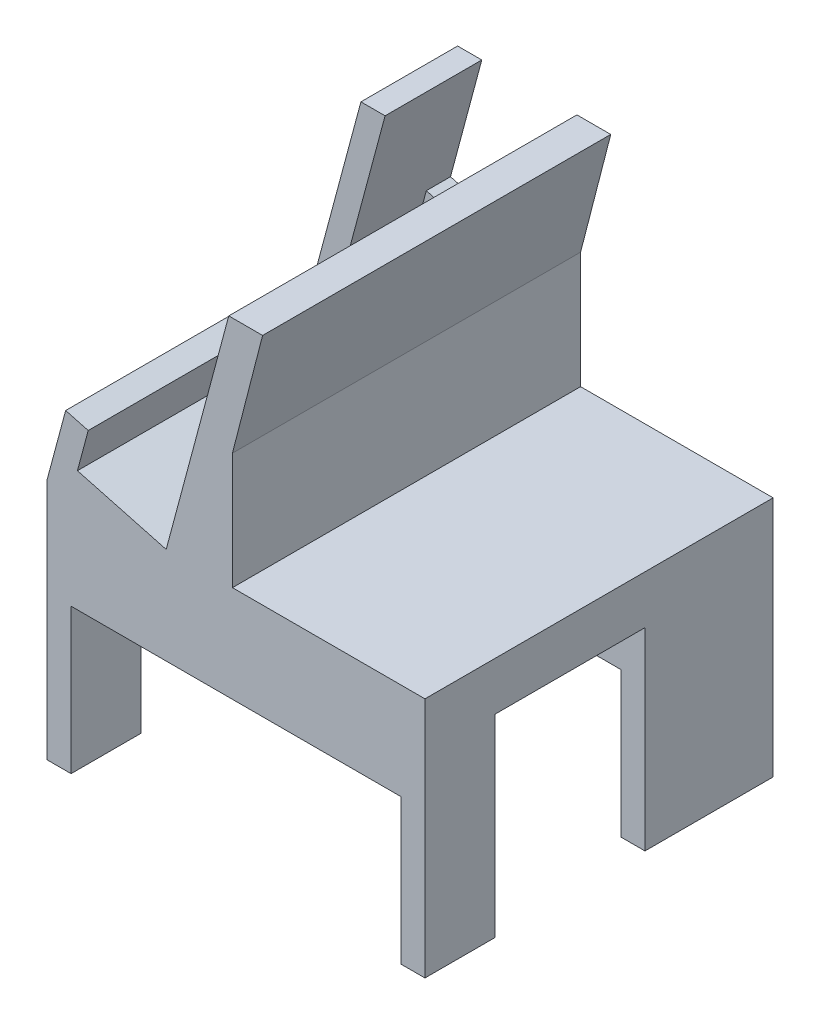
ISO-10303-21;
HEADER;
FILE_DESCRIPTION(('STEP AP214'),'2;1');
FILE_NAME('part.step','',(''),(''),'','','');
FILE_SCHEMA(('AUTOMOTIVE_DESIGN { 1 0 10303 214 1 1 1 1 }'));
ENDSEC;
DATA;
#1=APPLICATION_CONTEXT('core data for automotive mechanical design processes');
#2=APPLICATION_PROTOCOL_DEFINITION('international standard','automotive_design',2000,#1);
#3=PRODUCT_CONTEXT('',#1,'mechanical');
#4=PRODUCT('Part','Part','',(#3));
#5=PRODUCT_RELATED_PRODUCT_CATEGORY('part','',(#4));
#6=PRODUCT_DEFINITION_FORMATION('','',#4);
#7=PRODUCT_DEFINITION_CONTEXT('part definition',#1,'design');
#8=PRODUCT_DEFINITION('design','',#6,#7);
#9=PRODUCT_DEFINITION_SHAPE('','',#8);
#10=(LENGTH_UNIT() NAMED_UNIT(*) SI_UNIT(.MILLI.,.METRE.));
#11=(NAMED_UNIT(*) PLANE_ANGLE_UNIT() SI_UNIT($,.RADIAN.));
#12=(NAMED_UNIT(*) SI_UNIT($,.STERADIAN.) SOLID_ANGLE_UNIT());
#13=UNCERTAINTY_MEASURE_WITH_UNIT(LENGTH_MEASURE(1.E-05),#10,'distance_accuracy_value','');
#14=(GEOMETRIC_REPRESENTATION_CONTEXT(3) GLOBAL_UNCERTAINTY_ASSIGNED_CONTEXT((#13)) GLOBAL_UNIT_ASSIGNED_CONTEXT((#10,
#11,#12)) REPRESENTATION_CONTEXT('',''));
#15=CARTESIAN_POINT('',(0.,0.,0.));
#16=DIRECTION('',(0.,0.,1.));
#17=DIRECTION('',(1.,0.,0.));
#18=AXIS2_PLACEMENT_3D('',#15,#16,#17);
#19=CARTESIAN_POINT('',(0.,13.5714285714286,72.));
#20=DIRECTION('',(0.,1.,0.));
#21=DIRECTION('',(0.,0.,1.));
#22=AXIS2_PLACEMENT_3D('',#19,#20,#21);
#23=PLANE('',#22);
#24=DIRECTION('',(0.,0.,-1.));
#25=VECTOR('',#24,1.);
#26=CARTESIAN_POINT('',(-18.0389702359045,13.5714285714286,5.));
#27=LINE('',#26,#25);
#28=CARTESIAN_POINT('',(-18.0389702359045,13.5714285714286,72.));
#29=VERTEX_POINT('',#28);
#30=CARTESIAN_POINT('',(-18.0389702359045,13.5714285714286,0.));
#31=VERTEX_POINT('',#30);
#32=EDGE_CURVE('E384',#29,#31,#27,.T.);
#33=ORIENTED_EDGE('',*,*,#32,.F.);
#34=DIRECTION('',(1.,0.,0.));
#35=VECTOR('',#34,1.);
#36=CARTESIAN_POINT('',(0.,13.5714285714286,72.));
#37=LINE('',#36,#35);
#38=CARTESIAN_POINT('',(21.7764330264331,13.5714285714286,72.));
#39=VERTEX_POINT('',#38);
#40=EDGE_CURVE('E466',#29,#39,#37,.T.);
#41=ORIENTED_EDGE('',*,*,#40,.T.);
#42=DIRECTION('',(0.,0.,-1.));
#43=VECTOR('',#42,1.);
#44=CARTESIAN_POINT('',(21.7764330264331,13.5714285714286,72.));
#45=LINE('',#44,#43);
#46=CARTESIAN_POINT('',(21.7764330264331,13.5714285714286,0.));
#47=VERTEX_POINT('',#46);
#48=EDGE_CURVE('E497',#39,#47,#45,.T.);
#49=ORIENTED_EDGE('',*,*,#48,.T.);
#50=DIRECTION('',(1.,0.,0.));
#51=VECTOR('',#50,1.);
#52=CARTESIAN_POINT('',(0.,13.5714285714286,0.));
#53=LINE('',#52,#51);
#54=EDGE_CURVE('E489',#31,#47,#53,.T.);
#55=ORIENTED_EDGE('',*,*,#54,.F.);
#56=EDGE_LOOP('',(#33,#41,#49,#55));
#57=FACE_BOUND('',#56,.T.);
#58=ADVANCED_FACE('F101',(#57),#23,.T.);
#59=CARTESIAN_POINT('',(16.7764330264331,0.,72.));
#60=DIRECTION('',(1.,0.,0.));
#61=DIRECTION('',(0.,0.,-1.));
#62=AXIS2_PLACEMENT_3D('',#59,#60,#61);
#63=PLANE('',#62);
#64=DIRECTION('',(0.,0.,-1.));
#65=VECTOR('',#64,1.);
#66=CARTESIAN_POINT('',(16.7764330264331,-6.42857142857144,72.));
#67=LINE('',#66,#65);
#68=CARTESIAN_POINT('',(16.7764330264331,-6.42857142857144,72.));
#69=VERTEX_POINT('',#68);
#70=CARTESIAN_POINT('',(16.7764330264331,-6.42857142857144,57.5));
#71=VERTEX_POINT('',#70);
#72=EDGE_CURVE('E512',#69,#71,#67,.T.);
#73=ORIENTED_EDGE('',*,*,#72,.T.);
#74=DIRECTION('',(0.,-1.,0.));
#75=VECTOR('',#74,1.);
#76=CARTESIAN_POINT('',(16.7764330264331,3.57142857142857,57.5));
#77=LINE('',#76,#75);
#78=CARTESIAN_POINT('',(16.7764330264331,-36.4285714285714,57.5));
#79=VERTEX_POINT('',#78);
#80=EDGE_CURVE('E399',#71,#79,#77,.T.);
#81=ORIENTED_EDGE('',*,*,#80,.T.);
#82=DIRECTION('',(0.,0.,-1.));
#83=VECTOR('',#82,1.);
#84=CARTESIAN_POINT('',(16.7764330264331,-36.4285714285714,72.));
#85=LINE('',#84,#83);
#86=CARTESIAN_POINT('',(16.7764330264331,-36.4285714285714,72.));
#87=VERTEX_POINT('',#86);
#88=EDGE_CURVE('E507',#87,#79,#85,.T.);
#89=ORIENTED_EDGE('',*,*,#88,.F.);
#90=DIRECTION('',(0.,-1.,0.));
#91=VECTOR('',#90,1.);
#92=CARTESIAN_POINT('',(16.7764330264331,0.,72.));
#93=LINE('',#92,#91);
#94=EDGE_CURVE('E454',#69,#87,#93,.T.);
#95=ORIENTED_EDGE('',*,*,#94,.F.);
#96=EDGE_LOOP('',(#73,#81,#89,#95));
#97=FACE_BOUND('',#96,.T.);
#98=ADVANCED_FACE('F658',(#97),#63,.F.);
#99=CARTESIAN_POINT('',(0.,-36.4285714285714,72.));
#100=DIRECTION('',(0.,-1.,0.));
#101=DIRECTION('',(0.,0.,-1.));
#102=AXIS2_PLACEMENT_3D('',#99,#100,#101);
#103=PLANE('',#102);
#104=DIRECTION('',(-1.,0.,0.));
#105=VECTOR('',#104,1.);
#106=CARTESIAN_POINT('',(16.7764330264331,-36.4285714285714,57.5));
#107=LINE('',#106,#105);
#108=CARTESIAN_POINT('',(21.7764330264331,-36.4285714285714,57.5));
#109=VERTEX_POINT('',#108);
#110=EDGE_CURVE('E394',#109,#79,#107,.T.);
#111=ORIENTED_EDGE('',*,*,#110,.F.);
#112=DIRECTION('',(0.,0.,-1.));
#113=VECTOR('',#112,1.);
#114=CARTESIAN_POINT('',(21.7764330264331,-36.4285714285714,72.));
#115=LINE('',#114,#113);
#116=CARTESIAN_POINT('',(21.7764330264331,-36.4285714285714,72.));
#117=VERTEX_POINT('',#116);
#118=EDGE_CURVE('E502',#117,#109,#115,.T.);
#119=ORIENTED_EDGE('',*,*,#118,.F.);
#120=DIRECTION('',(-1.,0.,0.));
#121=VECTOR('',#120,1.);
#122=CARTESIAN_POINT('',(0.,-36.4285714285714,72.));
#123=LINE('',#122,#121);
#124=EDGE_CURVE('E458',#117,#87,#123,.T.);
#125=ORIENTED_EDGE('',*,*,#124,.T.);
#126=ORIENTED_EDGE('',*,*,#88,.T.);
#127=EDGE_LOOP('',(#111,#119,#125,#126));
#128=FACE_BOUND('',#127,.T.);
#129=ADVANCED_FACE('F663',(#128),#103,.T.);
#130=CARTESIAN_POINT('',(-56.4103801603801,-36.4285714285714,72.));
#131=DIRECTION('',(0.,1.,0.));
#132=DIRECTION('',(0.,0.,1.));
#133=AXIS2_PLACEMENT_3D('',#130,#131,#132);
#134=PLANE('',#133);
#135=DIRECTION('',(0.,0.,-1.));
#136=VECTOR('',#135,1.);
#137=CARTESIAN_POINT('',(-51.4103801603801,-36.4285714285714,72.));
#138=LINE('',#137,#136);
#139=CARTESIAN_POINT('',(-51.4103801603801,-36.4285714285714,26.5));
#140=VERTEX_POINT('',#139);
#141=CARTESIAN_POINT('',(-51.4103801603801,-36.4285714285714,0.));
#142=VERTEX_POINT('',#141);
#143=EDGE_CURVE('E529',#140,#142,#138,.T.);
#144=ORIENTED_EDGE('',*,*,#143,.F.);
#145=DIRECTION('',(1.,0.,0.));
#146=VECTOR('',#145,1.);
#147=CARTESIAN_POINT('',(-51.4103801603801,-36.4285714285714,26.5));
#148=LINE('',#147,#146);
#149=CARTESIAN_POINT('',(-56.4103801603801,-36.4285714285714,26.5));
#150=VERTEX_POINT('',#149);
#151=EDGE_CURVE('E418',#150,#140,#148,.T.);
#152=ORIENTED_EDGE('',*,*,#151,.F.);
#153=DIRECTION('',(0.,0.,-1.));
#154=VECTOR('',#153,1.);
#155=CARTESIAN_POINT('',(-56.4103801603801,-36.4285714285714,72.));
#156=LINE('',#155,#154);
#157=CARTESIAN_POINT('',(-56.4103801603801,-36.4285714285714,0.));
#158=VERTEX_POINT('',#157);
#159=EDGE_CURVE('E539',#150,#158,#156,.T.);
#160=ORIENTED_EDGE('',*,*,#159,.T.);
#161=DIRECTION('',(1.,0.,0.));
#162=VECTOR('',#161,1.);
#163=CARTESIAN_POINT('',(-56.4103801603801,-36.4285714285714,0.));
#164=LINE('',#163,#162);
#165=EDGE_CURVE('E526',#158,#142,#164,.T.);
#166=ORIENTED_EDGE('',*,*,#165,.T.);
#167=EDGE_LOOP('',(#144,#152,#160,#166));
#168=FACE_BOUND('',#167,.T.);
#169=ADVANCED_FACE('F643',(#168),#134,.F.);
#170=CARTESIAN_POINT('',(-51.4103801603801,-6.42857142857144,72.));
#171=DIRECTION('',(1.,0.,0.));
#172=DIRECTION('',(0.,1.,0.));
#173=AXIS2_PLACEMENT_3D('',#170,#171,#172);
#174=PLANE('',#173);
#175=DIRECTION('',(0.,-1.,0.));
#176=VECTOR('',#175,1.);
#177=CARTESIAN_POINT('',(-51.4103801603801,3.57142857142857,26.5));
#178=LINE('',#177,#176);
#179=CARTESIAN_POINT('',(-51.4103801603801,-6.42857142857144,26.5));
#180=VERTEX_POINT('',#179);
#181=EDGE_CURVE('E423',#180,#140,#178,.T.);
#182=ORIENTED_EDGE('',*,*,#181,.T.);
#183=ORIENTED_EDGE('',*,*,#143,.T.);
#184=DIRECTION('',(0.,-1.,0.));
#185=VECTOR('',#184,1.);
#186=CARTESIAN_POINT('',(-51.4103801603801,-6.42857142857144,0.));
#187=LINE('',#186,#185);
#188=CARTESIAN_POINT('',(-51.4103801603801,-6.42857142857144,0.));
#189=VERTEX_POINT('',#188);
#190=EDGE_CURVE('E444',#189,#142,#187,.T.);
#191=ORIENTED_EDGE('',*,*,#190,.F.);
#192=DIRECTION('',(0.,0.,-1.));
#193=VECTOR('',#192,1.);
#194=CARTESIAN_POINT('',(-51.4103801603801,-6.42857142857144,72.));
#195=LINE('',#194,#193);
#196=EDGE_CURVE('E516',#180,#189,#195,.T.);
#197=ORIENTED_EDGE('',*,*,#196,.F.);
#198=EDGE_LOOP('',(#182,#183,#191,#197));
#199=FACE_BOUND('',#198,.T.);
#200=ADVANCED_FACE('F638',(#199),#174,.T.);
#201=CARTESIAN_POINT('',(0.,-6.42857142857144,72.));
#202=DIRECTION('',(0.,1.,0.));
#203=DIRECTION('',(-1.,0.,0.));
#204=AXIS2_PLACEMENT_3D('',#201,#202,#203);
#205=PLANE('',#204);
#206=CARTESIAN_POINT('',(-51.4103801603801,-6.42857142857144,72.));
#207=VERTEX_POINT('',#206);
#208=CARTESIAN_POINT('',(-51.4103801603801,-6.42857142857144,57.5));
#209=VERTEX_POINT('',#208);
#210=EDGE_CURVE('E517',#207,#209,#195,.T.);
#211=ORIENTED_EDGE('',*,*,#210,.T.);
#212=DIRECTION('',(-1.,0.,0.));
#213=VECTOR('',#212,1.);
#214=CARTESIAN_POINT('',(-51.4103801603801,-6.42857142857144,57.5));
#215=LINE('',#214,#213);
#216=EDGE_CURVE('E441',#71,#209,#215,.T.);
#217=ORIENTED_EDGE('',*,*,#216,.F.);
#218=ORIENTED_EDGE('',*,*,#72,.F.);
#219=DIRECTION('',(1.,0.,0.));
#220=VECTOR('',#219,1.);
#221=CARTESIAN_POINT('',(0.,-6.42857142857144,72.));
#222=LINE('',#221,#220);
#223=EDGE_CURVE('E451',#207,#69,#222,.T.);
#224=ORIENTED_EDGE('',*,*,#223,.F.);
#225=EDGE_LOOP('',(#211,#217,#218,#224));
#226=FACE_BOUND('',#225,.T.);
#227=ADVANCED_FACE('F676',(#226),#205,.F.);
#228=CARTESIAN_POINT('',(16.7764330264331,-6.42857142857144,26.5));
#229=VERTEX_POINT('',#228);
#230=CARTESIAN_POINT('',(16.7764330264331,-6.42857142857144,0.));
#231=VERTEX_POINT('',#230);
#232=EDGE_CURVE('E511',#229,#231,#67,.T.);
#233=ORIENTED_EDGE('',*,*,#232,.F.);
#234=DIRECTION('',(1.,0.,0.));
#235=VECTOR('',#234,1.);
#236=CARTESIAN_POINT('',(-51.4103801603801,-6.42857142857144,26.5));
#237=LINE('',#236,#235);
#238=EDGE_CURVE('E427',#180,#229,#237,.T.);
#239=ORIENTED_EDGE('',*,*,#238,.F.);
#240=ORIENTED_EDGE('',*,*,#196,.T.);
#241=DIRECTION('',(1.,0.,0.));
#242=VECTOR('',#241,1.);
#243=CARTESIAN_POINT('',(0.,-6.42857142857144,0.));
#244=LINE('',#243,#242);
#245=EDGE_CURVE('E472',#189,#231,#244,.T.);
#246=ORIENTED_EDGE('',*,*,#245,.T.);
#247=EDGE_LOOP('',(#233,#239,#240,#246));
#248=FACE_BOUND('',#247,.T.);
#249=ADVANCED_FACE('F633',(#248),#205,.F.);
#250=CARTESIAN_POINT('',(16.7764330264331,-36.4285714285714,26.5));
#251=VERTEX_POINT('',#250);
#252=CARTESIAN_POINT('',(16.7764330264331,-36.4285714285714,0.));
#253=VERTEX_POINT('',#252);
#254=EDGE_CURVE('E506',#251,#253,#85,.T.);
#255=ORIENTED_EDGE('',*,*,#254,.F.);
#256=DIRECTION('',(0.,-1.,0.));
#257=VECTOR('',#256,1.);
#258=CARTESIAN_POINT('',(16.7764330264331,3.57142857142857,26.5));
#259=LINE('',#258,#257);
#260=EDGE_CURVE('E393',#229,#251,#259,.T.);
#261=ORIENTED_EDGE('',*,*,#260,.F.);
#262=ORIENTED_EDGE('',*,*,#232,.T.);
#263=DIRECTION('',(0.,-1.,0.));
#264=VECTOR('',#263,1.);
#265=CARTESIAN_POINT('',(16.7764330264331,0.,0.));
#266=LINE('',#265,#264);
#267=EDGE_CURVE('E476',#231,#253,#266,.T.);
#268=ORIENTED_EDGE('',*,*,#267,.T.);
#269=EDGE_LOOP('',(#255,#261,#262,#268));
#270=FACE_BOUND('',#269,.T.);
#271=ADVANCED_FACE('F628',(#270),#63,.F.);
#272=DIRECTION('',(1.,0.,0.));
#273=VECTOR('',#272,1.);
#274=CARTESIAN_POINT('',(16.7764330264331,-36.4285714285714,26.5));
#275=LINE('',#274,#273);
#276=CARTESIAN_POINT('',(21.7764330264331,-36.4285714285714,26.5));
#277=VERTEX_POINT('',#276);
#278=EDGE_CURVE('E388',#251,#277,#275,.T.);
#279=ORIENTED_EDGE('',*,*,#278,.F.);
#280=ORIENTED_EDGE('',*,*,#254,.T.);
#281=DIRECTION('',(-1.,0.,0.));
#282=VECTOR('',#281,1.);
#283=CARTESIAN_POINT('',(0.,-36.4285714285714,0.));
#284=LINE('',#283,#282);
#285=CARTESIAN_POINT('',(21.7764330264331,-36.4285714285714,0.));
#286=VERTEX_POINT('',#285);
#287=EDGE_CURVE('E481',#286,#253,#284,.T.);
#288=ORIENTED_EDGE('',*,*,#287,.F.);
#289=EDGE_CURVE('E501',#277,#286,#115,.T.);
#290=ORIENTED_EDGE('',*,*,#289,.F.);
#291=EDGE_LOOP('',(#279,#280,#288,#290));
#292=FACE_BOUND('',#291,.T.);
#293=ADVANCED_FACE('F624',(#292),#103,.T.);
#294=CARTESIAN_POINT('',(21.7764330264331,0.,72.));
#295=DIRECTION('',(-1.,0.,0.));
#296=DIRECTION('',(0.,-1.,0.));
#297=AXIS2_PLACEMENT_3D('',#294,#295,#296);
#298=PLANE('',#297);
#299=ORIENTED_EDGE('',*,*,#118,.T.);
#300=DIRECTION('',(0.,-1.,0.));
#301=VECTOR('',#300,1.);
#302=CARTESIAN_POINT('',(21.7764330264331,3.57142857142857,57.5));
#303=LINE('',#302,#301);
#304=CARTESIAN_POINT('',(21.7764330264331,3.57142857142857,57.5));
#305=VERTEX_POINT('',#304);
#306=EDGE_CURVE('E404',#305,#109,#303,.T.);
#307=ORIENTED_EDGE('',*,*,#306,.F.);
#308=DIRECTION('',(0.,0.,1.));
#309=VECTOR('',#308,1.);
#310=CARTESIAN_POINT('',(21.7764330264331,3.57142857142857,57.5));
#311=LINE('',#310,#309);
#312=CARTESIAN_POINT('',(21.7764330264331,3.57142857142857,26.5));
#313=VERTEX_POINT('',#312);
#314=EDGE_CURVE('E389',#313,#305,#311,.T.);
#315=ORIENTED_EDGE('',*,*,#314,.F.);
#316=DIRECTION('',(0.,-1.,0.));
#317=VECTOR('',#316,1.);
#318=CARTESIAN_POINT('',(21.7764330264331,3.57142857142857,26.5));
#319=LINE('',#318,#317);
#320=EDGE_CURVE('E407',#313,#277,#319,.T.);
#321=ORIENTED_EDGE('',*,*,#320,.T.);
#322=ORIENTED_EDGE('',*,*,#289,.T.);
#323=DIRECTION('',(0.,1.,0.));
#324=VECTOR('',#323,1.);
#325=CARTESIAN_POINT('',(21.7764330264331,0.,0.));
#326=LINE('',#325,#324);
#327=EDGE_CURVE('E485',#286,#47,#326,.T.);
#328=ORIENTED_EDGE('',*,*,#327,.T.);
#329=ORIENTED_EDGE('',*,*,#48,.F.);
#330=DIRECTION('',(0.,1.,0.));
#331=VECTOR('',#330,1.);
#332=CARTESIAN_POINT('',(21.7764330264331,0.,72.));
#333=LINE('',#332,#331);
#334=EDGE_CURVE('E462',#117,#39,#333,.T.);
#335=ORIENTED_EDGE('',*,*,#334,.F.);
#336=EDGE_LOOP('',(#299,#307,#315,#321,#322,#328,#329,#335));
#337=FACE_BOUND('',#336,.T.);
#338=ADVANCED_FACE('F618',(#337),#298,.F.);
#339=CARTESIAN_POINT('',(-56.4103801603801,0.,72.));
#340=DIRECTION('',(-1.,0.,0.));
#341=DIRECTION('',(0.,0.,1.));
#342=AXIS2_PLACEMENT_3D('',#339,#340,#341);
#343=PLANE('',#342);
#344=DIRECTION('',(0.,-1.,0.));
#345=VECTOR('',#344,1.);
#346=CARTESIAN_POINT('',(-56.4103801603801,3.57142857142857,26.5));
#347=LINE('',#346,#345);
#348=CARTESIAN_POINT('',(-56.4103801603801,3.57142857142857,26.5));
#349=VERTEX_POINT('',#348);
#350=EDGE_CURVE('E428',#349,#150,#347,.T.);
#351=ORIENTED_EDGE('',*,*,#350,.F.);
#352=DIRECTION('',(0.,0.,-1.));
#353=VECTOR('',#352,1.);
#354=CARTESIAN_POINT('',(-56.4103801603801,3.57142857142857,26.5));
#355=LINE('',#354,#353);
#356=CARTESIAN_POINT('',(-56.4103801603801,3.57142857142857,57.5));
#357=VERTEX_POINT('',#356);
#358=EDGE_CURVE('E413',#357,#349,#355,.T.);
#359=ORIENTED_EDGE('',*,*,#358,.F.);
#360=DIRECTION('',(0.,-1.,0.));
#361=VECTOR('',#360,1.);
#362=CARTESIAN_POINT('',(-56.4103801603801,3.57142857142857,57.5));
#363=LINE('',#362,#361);
#364=CARTESIAN_POINT('',(-56.4103801603801,-36.4285714285714,57.5));
#365=VERTEX_POINT('',#364);
#366=EDGE_CURVE('E431',#357,#365,#363,.T.);
#367=ORIENTED_EDGE('',*,*,#366,.T.);
#368=CARTESIAN_POINT('',(-56.4103801603801,-36.4285714285714,72.));
#369=VERTEX_POINT('',#368);
#370=EDGE_CURVE('E477',#369,#365,#156,.T.);
#371=ORIENTED_EDGE('',*,*,#370,.F.);
#372=DIRECTION('',(0.,1.,0.));
#373=VECTOR('',#372,1.);
#374=CARTESIAN_POINT('',(-56.4103801603801,0.,72.));
#375=LINE('',#374,#373);
#376=CARTESIAN_POINT('',(-56.4103801603801,13.5714285714286,72.));
#377=VERTEX_POINT('',#376);
#378=EDGE_CURVE('E469',#369,#377,#375,.T.);
#379=ORIENTED_EDGE('',*,*,#378,.T.);
#380=DIRECTION('',(0.,0.,-1.));
#381=VECTOR('',#380,1.);
#382=CARTESIAN_POINT('',(-56.4103801603801,13.5714285714286,72.));
#383=LINE('',#382,#381);
#384=CARTESIAN_POINT('',(-56.4103801603801,13.5714285714286,0.));
#385=VERTEX_POINT('',#384);
#386=EDGE_CURVE('E307',#377,#385,#383,.T.);
#387=ORIENTED_EDGE('',*,*,#386,.T.);
#388=DIRECTION('',(0.,1.,0.));
#389=VECTOR('',#388,1.);
#390=CARTESIAN_POINT('',(-56.4103801603801,0.,0.));
#391=LINE('',#390,#389);
#392=EDGE_CURVE('E455',#158,#385,#391,.T.);
#393=ORIENTED_EDGE('',*,*,#392,.F.);
#394=ORIENTED_EDGE('',*,*,#159,.F.);
#395=EDGE_LOOP('',(#351,#359,#367,#371,#379,#387,#393,#394));
#396=FACE_BOUND('',#395,.T.);
#397=ADVANCED_FACE('F668',(#396),#343,.T.);
#398=CARTESIAN_POINT('',(0.,0.,72.));
#399=DIRECTION('',(0.,0.,1.));
#400=DIRECTION('',(1.,0.,0.));
#401=AXIS2_PLACEMENT_3D('',#398,#399,#400);
#402=PLANE('',#401);
#403=DIRECTION('',(-0.965925826289069,0.258819045102518,0.));
#404=VECTOR('',#403,1.);
#405=CARTESIAN_POINT('',(-47.698465352397,26.766220740252,72.));
#406=LINE('',#405,#404);
#407=CARTESIAN_POINT('',(-47.8630309743813,26.8103159657646,72.));
#408=VERTEX_POINT('',#407);
#409=CARTESIAN_POINT('',(-52.5280944838424,28.0603159657646,72.));
#410=VERTEX_POINT('',#409);
#411=EDGE_CURVE('E288',#408,#410,#406,.T.);
#412=ORIENTED_EDGE('',*,*,#411,.T.);
#413=DIRECTION('',(-0.258819045102518,-0.965925826289069,0.));
#414=VECTOR('',#413,1.);
#415=CARTESIAN_POINT('',(-56.0244583510607,15.0117083715576,72.));
#416=LINE('',#415,#414);
#417=EDGE_CURVE('E297',#410,#377,#416,.T.);
#418=ORIENTED_EDGE('',*,*,#417,.T.);
#419=ORIENTED_EDGE('',*,*,#378,.F.);
#420=DIRECTION('',(1.,0.,0.));
#421=VECTOR('',#420,1.);
#422=CARTESIAN_POINT('',(-56.4103801603801,-36.4285714285714,72.));
#423=LINE('',#422,#421);
#424=CARTESIAN_POINT('',(-51.4103801603801,-36.4285714285714,72.));
#425=VERTEX_POINT('',#424);
#426=EDGE_CURVE('E525',#369,#425,#423,.T.);
#427=ORIENTED_EDGE('',*,*,#426,.T.);
#428=DIRECTION('',(0.,-1.,0.));
#429=VECTOR('',#428,1.);
#430=CARTESIAN_POINT('',(-51.4103801603801,-6.42857142857144,72.));
#431=LINE('',#430,#429);
#432=EDGE_CURVE('E521',#207,#425,#431,.T.);
#433=ORIENTED_EDGE('',*,*,#432,.F.);
#434=ORIENTED_EDGE('',*,*,#223,.T.);
#435=ORIENTED_EDGE('',*,*,#94,.T.);
#436=ORIENTED_EDGE('',*,*,#124,.F.);
#437=ORIENTED_EDGE('',*,*,#334,.T.);
#438=ORIENTED_EDGE('',*,*,#40,.F.);
#439=DIRECTION('',(0.,1.,0.));
#440=VECTOR('',#439,1.);
#441=CARTESIAN_POINT('',(-18.0389702359045,0.,72.));
#442=LINE('',#441,#440);
#443=CARTESIAN_POINT('',(-18.0389702359045,37.6589399957173,72.));
#444=VERTEX_POINT('',#443);
#445=EDGE_CURVE('E559',#29,#444,#442,.T.);
#446=ORIENTED_EDGE('',*,*,#445,.T.);
#447=DIRECTION('',(0.249591590337671,0.96835119560659,0.));
#448=VECTOR('',#447,1.);
#449=CARTESIAN_POINT('',(-26.0170916170386,6.70588036873319,72.));
#450=LINE('',#449,#448);
#451=CARTESIAN_POINT('',(-11.7991804774627,61.867719885882,72.));
#452=VERTEX_POINT('',#451);
#453=EDGE_CURVE('E591',#444,#452,#450,.T.);
#454=ORIENTED_EDGE('',*,*,#453,.T.);
#455=DIRECTION('',(-1.,0.,0.));
#456=VECTOR('',#455,1.);
#457=CARTESIAN_POINT('',(0.,61.867719885882,72.));
#458=LINE('',#457,#456);
#459=CARTESIAN_POINT('',(-18.7991804774627,61.867719885882,72.));
#460=VERTEX_POINT('',#459);
#461=EDGE_CURVE('E327',#452,#460,#458,.T.);
#462=ORIENTED_EDGE('',*,*,#461,.T.);
#463=DIRECTION('',(0.258819045102518,0.965925826289069,0.));
#464=VECTOR('',#463,1.);
#465=CARTESIAN_POINT('',(-33.0068041421073,8.84414651460977,72.));
#466=LINE('',#465,#464);
#467=CARTESIAN_POINT('',(-31.7401327325886,13.5714285714286,72.));
#468=VERTEX_POINT('',#467);
#469=EDGE_CURVE('E560',#468,#460,#466,.T.);
#470=ORIENTED_EDGE('',*,*,#469,.F.);
#471=DIRECTION('',(0.965925826289069,-0.258819045102518,0.));
#472=VECTOR('',#471,1.);
#473=CARTESIAN_POINT('',(1.26667140951872,4.72728205681878,72.));
#474=LINE('',#473,#472);
#475=CARTESIAN_POINT('',(-50.0927234320809,18.4889904283764,72.));
#476=VERTEX_POINT('',#475);
#477=EDGE_CURVE('E323',#476,#468,#474,.T.);
#478=ORIENTED_EDGE('',*,*,#477,.F.);
#479=DIRECTION('',(-0.258819045102518,-0.965925826289069,0.));
#480=VECTOR('',#479,1.);
#481=CARTESIAN_POINT('',(-51.3593948415996,13.7617083715576,72.));
#482=LINE('',#481,#480);
#483=EDGE_CURVE('E300',#408,#476,#482,.T.);
#484=ORIENTED_EDGE('',*,*,#483,.F.);
#485=EDGE_LOOP('',(#412,#418,#419,#427,#433,#434,#435,#436,#437,#438,#446,#454,#462,#470,#478,#484));
#486=FACE_BOUND('',#485,.T.);
#487=ADVANCED_FACE('F296',(#486),#402,.T.);
#488=CARTESIAN_POINT('',(0.,0.,0.));
#489=DIRECTION('',(0.,0.,1.));
#490=DIRECTION('',(1.,0.,0.));
#491=AXIS2_PLACEMENT_3D('',#488,#489,#490);
#492=PLANE('',#491);
#493=ORIENTED_EDGE('',*,*,#245,.F.);
#494=ORIENTED_EDGE('',*,*,#190,.T.);
#495=ORIENTED_EDGE('',*,*,#165,.F.);
#496=ORIENTED_EDGE('',*,*,#392,.T.);
#497=DIRECTION('',(-0.258819045102518,-0.965925826289069,0.));
#498=VECTOR('',#497,1.);
#499=CARTESIAN_POINT('',(-56.4103801603801,13.5714285714286,0.));
#500=LINE('',#499,#498);
#501=CARTESIAN_POINT('',(-43.4694279052542,61.867719885882,0.));
#502=VERTEX_POINT('',#501);
#503=EDGE_CURVE('E336',#502,#385,#500,.T.);
#504=ORIENTED_EDGE('',*,*,#503,.F.);
#505=DIRECTION('',(-1.,0.,0.));
#506=VECTOR('',#505,1.);
#507=CARTESIAN_POINT('',(-43.4694279052542,61.867719885882,0.));
#508=LINE('',#507,#506);
#509=CARTESIAN_POINT('',(-38.4694279052542,61.867719885882,0.));
#510=VERTEX_POINT('',#509);
#511=EDGE_CURVE('E353',#510,#502,#508,.T.);
#512=ORIENTED_EDGE('',*,*,#511,.F.);
#513=DIRECTION('',(0.258819045102518,0.965925826289069,0.));
#514=VECTOR('',#513,1.);
#515=CARTESIAN_POINT('',(-38.4694279052542,61.867719885882,0.));
#516=LINE('',#515,#514);
#517=CARTESIAN_POINT('',(-44.9399040328172,37.7195742286553,0.));
#518=VERTEX_POINT('',#517);
#519=EDGE_CURVE('E349',#518,#510,#516,.T.);
#520=ORIENTED_EDGE('',*,*,#519,.F.);
#521=DIRECTION('',(-0.965925826289069,0.258819045102518,0.));
#522=VECTOR('',#521,1.);
#523=CARTESIAN_POINT('',(-44.9399040328172,37.7195742286553,0.));
#524=LINE('',#523,#522);
#525=CARTESIAN_POINT('',(-26.5873133333249,32.8020123717075,0.));
#526=VERTEX_POINT('',#525);
#527=EDGE_CURVE('E346',#526,#518,#524,.T.);
#528=ORIENTED_EDGE('',*,*,#527,.F.);
#529=DIRECTION('',(-0.258819045102517,-0.965925826289069,0.));
#530=VECTOR('',#529,1.);
#531=CARTESIAN_POINT('',(-26.5873133333249,32.8020123717075,0.));
#532=LINE('',#531,#530);
#533=CARTESIAN_POINT('',(-18.7991804774627,61.867719885882,0.));
#534=VERTEX_POINT('',#533);
#535=EDGE_CURVE('E343',#534,#526,#532,.T.);
#536=ORIENTED_EDGE('',*,*,#535,.F.);
#537=DIRECTION('',(-1.,0.,0.));
#538=VECTOR('',#537,1.);
#539=CARTESIAN_POINT('',(-18.7991804774627,61.867719885882,0.));
#540=LINE('',#539,#538);
#541=CARTESIAN_POINT('',(-11.7991804774627,61.867719885882,0.));
#542=VERTEX_POINT('',#541);
#543=EDGE_CURVE('E340',#542,#534,#540,.T.);
#544=ORIENTED_EDGE('',*,*,#543,.F.);
#545=DIRECTION('',(0.249591590337671,0.96835119560659,0.));
#546=VECTOR('',#545,1.);
#547=CARTESIAN_POINT('',(-11.7991804774627,61.867719885882,0.));
#548=LINE('',#547,#546);
#549=CARTESIAN_POINT('',(-18.0389702359045,37.6589399957173,0.));
#550=VERTEX_POINT('',#549);
#551=EDGE_CURVE('E314',#550,#542,#548,.T.);
#552=ORIENTED_EDGE('',*,*,#551,.F.);
#553=DIRECTION('',(0.,1.,0.));
#554=VECTOR('',#553,1.);
#555=CARTESIAN_POINT('',(-18.0389702359045,37.6589399957173,0.));
#556=LINE('',#555,#554);
#557=EDGE_CURVE('E309',#31,#550,#556,.T.);
#558=ORIENTED_EDGE('',*,*,#557,.F.);
#559=ORIENTED_EDGE('',*,*,#54,.T.);
#560=ORIENTED_EDGE('',*,*,#327,.F.);
#561=ORIENTED_EDGE('',*,*,#287,.T.);
#562=ORIENTED_EDGE('',*,*,#267,.F.);
#563=EDGE_LOOP('',(#493,#494,#495,#496,#504,#512,#520,#528,#536,#544,#552,#558,#559,#560,#561,#562));
#564=FACE_BOUND('',#563,.T.);
#565=ADVANCED_FACE('F568',(#564),#492,.F.);
#566=ORIENTED_EDGE('',*,*,#370,.T.);
#567=DIRECTION('',(-1.,0.,0.));
#568=VECTOR('',#567,1.);
#569=CARTESIAN_POINT('',(-51.4103801603801,-36.4285714285714,57.5));
#570=LINE('',#569,#568);
#571=CARTESIAN_POINT('',(-51.4103801603801,-36.4285714285714,57.5));
#572=VERTEX_POINT('',#571);
#573=EDGE_CURVE('E403',#572,#365,#570,.T.);
#574=ORIENTED_EDGE('',*,*,#573,.F.);
#575=EDGE_CURVE('E540',#425,#572,#138,.T.);
#576=ORIENTED_EDGE('',*,*,#575,.F.);
#577=ORIENTED_EDGE('',*,*,#426,.F.);
#578=EDGE_LOOP('',(#566,#574,#576,#577));
#579=FACE_BOUND('',#578,.T.);
#580=ADVANCED_FACE('F677',(#579),#134,.F.);
#581=DIRECTION('',(0.,-1.,0.));
#582=VECTOR('',#581,1.);
#583=CARTESIAN_POINT('',(-51.4103801603801,3.57142857142857,57.5));
#584=LINE('',#583,#582);
#585=EDGE_CURVE('E417',#209,#572,#584,.T.);
#586=ORIENTED_EDGE('',*,*,#585,.F.);
#587=ORIENTED_EDGE('',*,*,#210,.F.);
#588=ORIENTED_EDGE('',*,*,#432,.T.);
#589=ORIENTED_EDGE('',*,*,#575,.T.);
#590=EDGE_LOOP('',(#586,#587,#588,#589));
#591=FACE_BOUND('',#590,.T.);
#592=ADVANCED_FACE('F103',(#591),#174,.T.);
#593=CARTESIAN_POINT('',(-51.4103801603801,3.57142857142856,57.5));
#594=DIRECTION('',(0.,0.,1.));
#595=DIRECTION('',(1.,0.,0.));
#596=AXIS2_PLACEMENT_3D('',#593,#594,#595);
#597=PLANE('',#596);
#598=ORIENTED_EDGE('',*,*,#216,.T.);
#599=ORIENTED_EDGE('',*,*,#585,.T.);
#600=ORIENTED_EDGE('',*,*,#573,.T.);
#601=ORIENTED_EDGE('',*,*,#366,.F.);
#602=DIRECTION('',(-1.,0.,0.));
#603=VECTOR('',#602,1.);
#604=CARTESIAN_POINT('',(-51.4103801603801,3.57142857142856,57.5));
#605=LINE('',#604,#603);
#606=EDGE_CURVE('E440',#305,#357,#605,.T.);
#607=ORIENTED_EDGE('',*,*,#606,.F.);
#608=ORIENTED_EDGE('',*,*,#306,.T.);
#609=ORIENTED_EDGE('',*,*,#110,.T.);
#610=ORIENTED_EDGE('',*,*,#80,.F.);
#611=EDGE_LOOP('',(#598,#599,#600,#601,#607,#608,#609,#610));
#612=FACE_BOUND('',#611,.T.);
#613=ADVANCED_FACE('F684',(#612),#597,.F.);
#614=CARTESIAN_POINT('',(-51.4103801603801,3.57142857142856,26.5));
#615=DIRECTION('',(0.,0.,-1.));
#616=DIRECTION('',(-1.,0.,0.));
#617=AXIS2_PLACEMENT_3D('',#614,#615,#616);
#618=PLANE('',#617);
#619=ORIENTED_EDGE('',*,*,#238,.T.);
#620=ORIENTED_EDGE('',*,*,#260,.T.);
#621=ORIENTED_EDGE('',*,*,#278,.T.);
#622=ORIENTED_EDGE('',*,*,#320,.F.);
#623=DIRECTION('',(1.,0.,0.));
#624=VECTOR('',#623,1.);
#625=CARTESIAN_POINT('',(-51.4103801603801,3.57142857142856,26.5));
#626=LINE('',#625,#624);
#627=EDGE_CURVE('E437',#349,#313,#626,.T.);
#628=ORIENTED_EDGE('',*,*,#627,.F.);
#629=ORIENTED_EDGE('',*,*,#350,.T.);
#630=ORIENTED_EDGE('',*,*,#151,.T.);
#631=ORIENTED_EDGE('',*,*,#181,.F.);
#632=EDGE_LOOP('',(#619,#620,#621,#622,#628,#629,#630,#631));
#633=FACE_BOUND('',#632,.T.);
#634=ADVANCED_FACE('F760',(#633),#618,.F.);
#635=CARTESIAN_POINT('',(0.,3.57142857142856,0.));
#636=DIRECTION('',(0.,1.,0.));
#637=DIRECTION('',(-1.,0.,0.));
#638=AXIS2_PLACEMENT_3D('',#635,#636,#637);
#639=PLANE('',#638);
#640=ORIENTED_EDGE('',*,*,#606,.T.);
#641=ORIENTED_EDGE('',*,*,#358,.T.);
#642=ORIENTED_EDGE('',*,*,#627,.T.);
#643=ORIENTED_EDGE('',*,*,#314,.T.);
#644=EDGE_LOOP('',(#640,#641,#642,#643));
#645=FACE_BOUND('',#644,.T.);
#646=ADVANCED_FACE('F706',(#645),#639,.F.);
#647=CARTESIAN_POINT('',(-18.0389702359045,37.6589399957173,5.));
#648=DIRECTION('',(-1.,0.,0.));
#649=DIRECTION('',(0.,-1.,0.));
#650=AXIS2_PLACEMENT_3D('',#647,#648,#649);
#651=PLANE('',#650);
#652=ORIENTED_EDGE('',*,*,#557,.T.);
#653=DIRECTION('',(0.,0.,-1.));
#654=VECTOR('',#653,1.);
#655=CARTESIAN_POINT('',(-18.0389702359045,37.6589399957173,5.));
#656=LINE('',#655,#654);
#657=EDGE_CURVE('E380',#444,#550,#656,.T.);
#658=ORIENTED_EDGE('',*,*,#657,.F.);
#659=ORIENTED_EDGE('',*,*,#445,.F.);
#660=ORIENTED_EDGE('',*,*,#32,.T.);
#661=EDGE_LOOP('',(#652,#658,#659,#660));
#662=FACE_BOUND('',#661,.T.);
#663=ADVANCED_FACE('F613',(#662),#651,.F.);
#664=CARTESIAN_POINT('',(-11.7991804774627,61.867719885882,5.));
#665=DIRECTION('',(-0.96835119560659,0.249591590337671,0.));
#666=DIRECTION('',(-0.249591590337671,-0.96835119560659,0.));
#667=AXIS2_PLACEMENT_3D('',#664,#665,#666);
#668=PLANE('',#667);
#669=ORIENTED_EDGE('',*,*,#551,.T.);
#670=DIRECTION('',(0.,0.,-1.));
#671=VECTOR('',#670,1.);
#672=CARTESIAN_POINT('',(-11.7991804774627,61.867719885882,5.));
#673=LINE('',#672,#671);
#674=EDGE_CURVE('E376',#452,#542,#673,.T.);
#675=ORIENTED_EDGE('',*,*,#674,.F.);
#676=ORIENTED_EDGE('',*,*,#453,.F.);
#677=ORIENTED_EDGE('',*,*,#657,.T.);
#678=EDGE_LOOP('',(#669,#675,#676,#677));
#679=FACE_BOUND('',#678,.T.);
#680=ADVANCED_FACE('F606',(#679),#668,.F.);
#681=CARTESIAN_POINT('',(-18.7991804774627,61.867719885882,5.));
#682=DIRECTION('',(0.,-1.,0.));
#683=DIRECTION('',(0.,0.,-1.));
#684=AXIS2_PLACEMENT_3D('',#681,#682,#683);
#685=PLANE('',#684);
#686=ORIENTED_EDGE('',*,*,#543,.T.);
#687=DIRECTION('',(0.,0.,-1.));
#688=VECTOR('',#687,1.);
#689=CARTESIAN_POINT('',(-18.7991804774627,61.867719885882,5.));
#690=LINE('',#689,#688);
#691=EDGE_CURVE('E372',#460,#534,#690,.T.);
#692=ORIENTED_EDGE('',*,*,#691,.F.);
#693=ORIENTED_EDGE('',*,*,#461,.F.);
#694=ORIENTED_EDGE('',*,*,#674,.T.);
#695=EDGE_LOOP('',(#686,#692,#693,#694));
#696=FACE_BOUND('',#695,.T.);
#697=ADVANCED_FACE('F609',(#696),#685,.F.);
#698=CARTESIAN_POINT('',(-26.5873133333249,32.8020123717075,5.));
#699=DIRECTION('',(0.965925826289069,-0.258819045102518,0.));
#700=DIRECTION('',(0.258819045102518,0.965925826289069,0.));
#701=AXIS2_PLACEMENT_3D('',#698,#699,#700);
#702=PLANE('',#701);
#703=ORIENTED_EDGE('',*,*,#535,.T.);
#704=DIRECTION('',(0.,0.,-1.));
#705=VECTOR('',#704,1.);
#706=CARTESIAN_POINT('',(-26.5873133333249,32.8020123717075,5.));
#707=LINE('',#706,#705);
#708=CARTESIAN_POINT('',(-26.5873133333249,32.8020123717075,5.));
#709=VERTEX_POINT('',#708);
#710=EDGE_CURVE('E368',#709,#526,#707,.T.);
#711=ORIENTED_EDGE('',*,*,#710,.F.);
#712=DIRECTION('',(0.258819045102518,0.965925826289069,0.));
#713=VECTOR('',#712,1.);
#714=CARTESIAN_POINT('',(-33.0068041421073,8.84414651460977,5.));
#715=LINE('',#714,#713);
#716=CARTESIAN_POINT('',(-31.7401327325886,13.5714285714286,5.));
#717=VERTEX_POINT('',#716);
#718=EDGE_CURVE('E554',#717,#709,#715,.T.);
#719=ORIENTED_EDGE('',*,*,#718,.F.);
#720=DIRECTION('',(0.,0.,-1.));
#721=VECTOR('',#720,1.);
#722=CARTESIAN_POINT('',(-31.7401327325886,13.5714285714286,126.232396801903));
#723=LINE('',#722,#721);
#724=EDGE_CURVE('E322',#468,#717,#723,.T.);
#725=ORIENTED_EDGE('',*,*,#724,.F.);
#726=ORIENTED_EDGE('',*,*,#469,.T.);
#727=ORIENTED_EDGE('',*,*,#691,.T.);
#728=EDGE_LOOP('',(#703,#711,#719,#725,#726,#727));
#729=FACE_BOUND('',#728,.T.);
#730=ADVANCED_FACE('F561',(#729),#702,.F.);
#731=CARTESIAN_POINT('',(-44.9399040328172,37.7195742286553,5.));
#732=DIRECTION('',(-0.258819045102518,-0.965925826289069,0.));
#733=DIRECTION('',(0.965925826289069,-0.258819045102518,0.));
#734=AXIS2_PLACEMENT_3D('',#731,#732,#733);
#735=PLANE('',#734);
#736=ORIENTED_EDGE('',*,*,#527,.T.);
#737=DIRECTION('',(0.,0.,-1.));
#738=VECTOR('',#737,1.);
#739=CARTESIAN_POINT('',(-44.9399040328172,37.7195742286553,5.));
#740=LINE('',#739,#738);
#741=CARTESIAN_POINT('',(-44.9399040328172,37.7195742286553,5.));
#742=VERTEX_POINT('',#741);
#743=EDGE_CURVE('E364',#742,#518,#740,.T.);
#744=ORIENTED_EDGE('',*,*,#743,.F.);
#745=DIRECTION('',(-0.965925826289069,0.258819045102518,0.));
#746=VECTOR('',#745,1.);
#747=CARTESIAN_POINT('',(-44.9399040328172,37.7195742286553,5.));
#748=LINE('',#747,#746);
#749=EDGE_CURVE('E333',#709,#742,#748,.T.);
#750=ORIENTED_EDGE('',*,*,#749,.F.);
#751=ORIENTED_EDGE('',*,*,#710,.T.);
#752=EDGE_LOOP('',(#736,#744,#750,#751));
#753=FACE_BOUND('',#752,.T.);
#754=ADVANCED_FACE('F565',(#753),#735,.F.);
#755=CARTESIAN_POINT('',(-38.4694279052542,61.867719885882,5.));
#756=DIRECTION('',(-0.965925826289069,0.258819045102518,0.));
#757=DIRECTION('',(-0.258819045102518,-0.965925826289069,0.));
#758=AXIS2_PLACEMENT_3D('',#755,#756,#757);
#759=PLANE('',#758);
#760=DIRECTION('',(0.,0.,-1.));
#761=VECTOR('',#760,1.);
#762=CARTESIAN_POINT('',(-38.4694279052542,61.867719885882,5.));
#763=LINE('',#762,#761);
#764=CARTESIAN_POINT('',(-38.4694279052542,61.867719885882,20.));
#765=VERTEX_POINT('',#764);
#766=EDGE_CURVE('E361',#765,#510,#763,.T.);
#767=ORIENTED_EDGE('',*,*,#766,.F.);
#768=DIRECTION('',(-0.258819045102518,-0.965925826289069,0.));
#769=VECTOR('',#768,1.);
#770=CARTESIAN_POINT('',(-38.4694279052542,61.867719885882,20.));
#771=LINE('',#770,#769);
#772=CARTESIAN_POINT('',(-47.8630309743813,26.8103159657646,20.));
#773=VERTEX_POINT('',#772);
#774=EDGE_CURVE('E573',#765,#773,#771,.T.);
#775=ORIENTED_EDGE('',*,*,#774,.T.);
#776=DIRECTION('',(0.,0.,1.));
#777=VECTOR('',#776,1.);
#778=CARTESIAN_POINT('',(-47.8630309743813,26.8103159657646,5.));
#779=LINE('',#778,#777);
#780=EDGE_CURVE('E302',#773,#408,#779,.T.);
#781=ORIENTED_EDGE('',*,*,#780,.T.);
#782=ORIENTED_EDGE('',*,*,#483,.T.);
#783=DIRECTION('',(0.,0.,-1.));
#784=VECTOR('',#783,1.);
#785=CARTESIAN_POINT('',(-50.0927234320809,18.4889904283764,126.232396801903));
#786=LINE('',#785,#784);
#787=CARTESIAN_POINT('',(-50.0927234320809,18.4889904283764,5.));
#788=VERTEX_POINT('',#787);
#789=EDGE_CURVE('E316',#476,#788,#786,.T.);
#790=ORIENTED_EDGE('',*,*,#789,.T.);
#791=DIRECTION('',(0.258819045102518,0.965925826289069,0.));
#792=VECTOR('',#791,1.);
#793=CARTESIAN_POINT('',(-51.3593948415996,13.7617083715576,5.));
#794=LINE('',#793,#792);
#795=EDGE_CURVE('E110',#788,#742,#794,.T.);
#796=ORIENTED_EDGE('',*,*,#795,.T.);
#797=ORIENTED_EDGE('',*,*,#743,.T.);
#798=ORIENTED_EDGE('',*,*,#519,.T.);
#799=EDGE_LOOP('',(#767,#775,#781,#782,#790,#796,#797,#798));
#800=FACE_BOUND('',#799,.T.);
#801=ADVANCED_FACE('F546',(#800),#759,.F.);
#802=CARTESIAN_POINT('',(-43.4694279052542,61.867719885882,5.));
#803=DIRECTION('',(0.,-1.,0.));
#804=DIRECTION('',(0.,0.,-1.));
#805=AXIS2_PLACEMENT_3D('',#802,#803,#804);
#806=PLANE('',#805);
#807=DIRECTION('',(0.,0.,-1.));
#808=VECTOR('',#807,1.);
#809=CARTESIAN_POINT('',(-43.4694279052542,61.867719885882,5.));
#810=LINE('',#809,#808);
#811=CARTESIAN_POINT('',(-43.4694279052543,61.867719885882,20.));
#812=VERTEX_POINT('',#811);
#813=EDGE_CURVE('E335',#812,#502,#810,.T.);
#814=ORIENTED_EDGE('',*,*,#813,.F.);
#815=DIRECTION('',(1.,0.,0.));
#816=VECTOR('',#815,1.);
#817=CARTESIAN_POINT('',(-43.4694279052542,61.867719885882,20.));
#818=LINE('',#817,#816);
#819=EDGE_CURVE('E578',#812,#765,#818,.T.);
#820=ORIENTED_EDGE('',*,*,#819,.T.);
#821=ORIENTED_EDGE('',*,*,#766,.T.);
#822=ORIENTED_EDGE('',*,*,#511,.T.);
#823=EDGE_LOOP('',(#814,#820,#821,#822));
#824=FACE_BOUND('',#823,.T.);
#825=ADVANCED_FACE('F577',(#824),#806,.F.);
#826=CARTESIAN_POINT('',(-56.4103801603801,13.5714285714286,5.));
#827=DIRECTION('',(0.965925826289069,-0.258819045102518,0.));
#828=DIRECTION('',(0.258819045102518,0.965925826289069,0.));
#829=AXIS2_PLACEMENT_3D('',#826,#827,#828);
#830=PLANE('',#829);
#831=DIRECTION('',(0.,0.,1.));
#832=VECTOR('',#831,1.);
#833=CARTESIAN_POINT('',(-52.5280944838424,28.0603159657646,20.));
#834=LINE('',#833,#832);
#835=CARTESIAN_POINT('',(-52.5280944838424,28.0603159657646,20.));
#836=VERTEX_POINT('',#835);
#837=EDGE_CURVE('E285',#836,#410,#834,.T.);
#838=ORIENTED_EDGE('',*,*,#837,.F.);
#839=DIRECTION('',(0.258819045102518,0.965925826289069,0.));
#840=VECTOR('',#839,1.);
#841=CARTESIAN_POINT('',(-56.4103801603801,13.5714285714286,20.));
#842=LINE('',#841,#840);
#843=EDGE_CURVE('E12',#836,#812,#842,.T.);
#844=ORIENTED_EDGE('',*,*,#843,.T.);
#845=ORIENTED_EDGE('',*,*,#813,.T.);
#846=ORIENTED_EDGE('',*,*,#503,.T.);
#847=ORIENTED_EDGE('',*,*,#386,.F.);
#848=ORIENTED_EDGE('',*,*,#417,.F.);
#849=EDGE_LOOP('',(#838,#844,#845,#846,#847,#848));
#850=FACE_BOUND('',#849,.T.);
#851=ADVANCED_FACE('F305',(#850),#830,.F.);
#852=CARTESIAN_POINT('',(0.,0.,5.));
#853=DIRECTION('',(0.,0.,1.));
#854=DIRECTION('',(1.,0.,0.));
#855=AXIS2_PLACEMENT_3D('',#852,#853,#854);
#856=PLANE('',#855);
#857=ORIENTED_EDGE('',*,*,#718,.T.);
#858=ORIENTED_EDGE('',*,*,#749,.T.);
#859=ORIENTED_EDGE('',*,*,#795,.F.);
#860=DIRECTION('',(0.965925826289069,-0.258819045102518,0.));
#861=VECTOR('',#860,1.);
#862=CARTESIAN_POINT('',(1.26667140951872,4.72728205681878,5.));
#863=LINE('',#862,#861);
#864=EDGE_CURVE('E310',#788,#717,#863,.T.);
#865=ORIENTED_EDGE('',*,*,#864,.T.);
#866=EDGE_LOOP('',(#857,#858,#859,#865));
#867=FACE_BOUND('',#866,.T.);
#868=ADVANCED_FACE('F553',(#867),#856,.T.);
#869=CARTESIAN_POINT('',(1.26667140951872,4.72728205681878,126.232396801903));
#870=DIRECTION('',(0.258819045102518,0.965925826289069,0.));
#871=DIRECTION('',(-0.965925826289069,0.258819045102518,0.));
#872=AXIS2_PLACEMENT_3D('',#869,#870,#871);
#873=PLANE('',#872);
#874=ORIENTED_EDGE('',*,*,#789,.F.);
#875=ORIENTED_EDGE('',*,*,#477,.T.);
#876=ORIENTED_EDGE('',*,*,#724,.T.);
#877=ORIENTED_EDGE('',*,*,#864,.F.);
#878=EDGE_LOOP('',(#874,#875,#876,#877));
#879=FACE_BOUND('',#878,.T.);
#880=ADVANCED_FACE('F552',(#879),#873,.T.);
#881=CARTESIAN_POINT('',(-38.1945124324126,62.2354559103768,20.));
#882=DIRECTION('',(0.,0.,-1.));
#883=DIRECTION('',(-1.,0.,0.));
#884=AXIS2_PLACEMENT_3D('',#881,#882,#883);
#885=PLANE('',#884);
#886=ORIENTED_EDGE('',*,*,#819,.F.);
#887=ORIENTED_EDGE('',*,*,#843,.F.);
#888=DIRECTION('',(-0.965925826289069,0.258819045102518,0.));
#889=VECTOR('',#888,1.);
#890=CARTESIAN_POINT('',(-47.698465352397,26.766220740252,20.));
#891=LINE('',#890,#889);
#892=EDGE_CURVE('E117',#773,#836,#891,.T.);
#893=ORIENTED_EDGE('',*,*,#892,.F.);
#894=ORIENTED_EDGE('',*,*,#774,.F.);
#895=EDGE_LOOP('',(#886,#887,#893,#894));
#896=FACE_BOUND('',#895,.T.);
#897=ADVANCED_FACE('F647',(#896),#885,.F.);
#898=CARTESIAN_POINT('',(-47.698465352397,26.766220740252,20.));
#899=DIRECTION('',(-0.258819045102518,-0.965925826289069,0.));
#900=DIRECTION('',(0.965925826289069,-0.258819045102518,0.));
#901=AXIS2_PLACEMENT_3D('',#898,#899,#900);
#902=PLANE('',#901);
#903=ORIENTED_EDGE('',*,*,#892,.T.);
#904=ORIENTED_EDGE('',*,*,#837,.T.);
#905=ORIENTED_EDGE('',*,*,#411,.F.);
#906=ORIENTED_EDGE('',*,*,#780,.F.);
#907=EDGE_LOOP('',(#903,#904,#905,#906));
#908=FACE_BOUND('',#907,.T.);
#909=ADVANCED_FACE('F287',(#908),#902,.F.);
#910=CLOSED_SHELL('',(#58,#98,#129,#169,#200,#227,#249,#271,#293,#338,#397,#487,#565,#580,#592,
#613,#634,#646,#663,#680,#697,#730,#754,#801,#825,#851,#868,#880,#897,#909));
#911=MANIFOLD_SOLID_BREP('B2',#910);
#912=ADVANCED_BREP_SHAPE_REPRESENTATION('',(#18,#911),#14);
#913=SHAPE_DEFINITION_REPRESENTATION(#9,#912);
ENDSEC;
END-ISO-10303-21;
